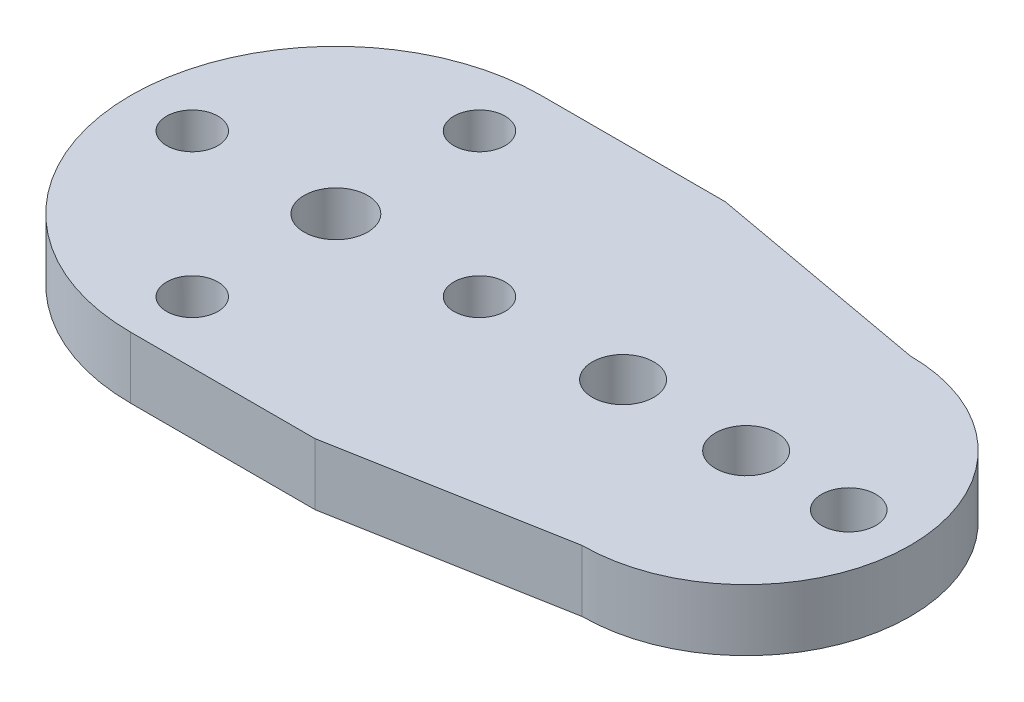
ISO-10303-21;
HEADER;
FILE_DESCRIPTION(('STEP AP214'),'2;1');
FILE_NAME('part.step','',(''),(''),'','','');
FILE_SCHEMA(('AUTOMOTIVE_DESIGN { 1 0 10303 214 1 1 1 1 }'));
ENDSEC;
DATA;
#1=APPLICATION_CONTEXT('core data for automotive mechanical design processes');
#2=APPLICATION_PROTOCOL_DEFINITION('international standard','automotive_design',2000,#1);
#3=PRODUCT_CONTEXT('',#1,'mechanical');
#4=PRODUCT('Part','Part','',(#3));
#5=PRODUCT_RELATED_PRODUCT_CATEGORY('part','',(#4));
#6=PRODUCT_DEFINITION_FORMATION('','',#4);
#7=PRODUCT_DEFINITION_CONTEXT('part definition',#1,'design');
#8=PRODUCT_DEFINITION('design','',#6,#7);
#9=PRODUCT_DEFINITION_SHAPE('','',#8);
#10=(LENGTH_UNIT() NAMED_UNIT(*) SI_UNIT(.MILLI.,.METRE.));
#11=(NAMED_UNIT(*) PLANE_ANGLE_UNIT() SI_UNIT($,.RADIAN.));
#12=(NAMED_UNIT(*) SI_UNIT($,.STERADIAN.) SOLID_ANGLE_UNIT());
#13=UNCERTAINTY_MEASURE_WITH_UNIT(LENGTH_MEASURE(1.E-05),#10,'distance_accuracy_value','');
#14=(GEOMETRIC_REPRESENTATION_CONTEXT(3) GLOBAL_UNCERTAINTY_ASSIGNED_CONTEXT((#13)) GLOBAL_UNIT_ASSIGNED_CONTEXT((#10,
#11,#12)) REPRESENTATION_CONTEXT('',''));
#15=CARTESIAN_POINT('',(0.,0.,0.));
#16=DIRECTION('',(0.,0.,1.));
#17=DIRECTION('',(1.,0.,0.));
#18=AXIS2_PLACEMENT_3D('',#15,#16,#17);
#19=CARTESIAN_POINT('',(-60.,3.,-9.99999999999999));
#20=DIRECTION('',(0.,1.,0.));
#21=DIRECTION('',(0.,0.,1.));
#22=AXIS2_PLACEMENT_3D('',#19,#20,#21);
#23=PLANE('',#22);
#24=CARTESIAN_POINT('',(-80.,3.,-17.));
#25=DIRECTION('',(0.,1.,0.));
#26=DIRECTION('',(0.,0.,1.));
#27=AXIS2_PLACEMENT_3D('',#24,#25,#26);
#28=CIRCLE('',#27,1.25);
#29=CARTESIAN_POINT('',(-80.,3.,-15.75));
#30=VERTEX_POINT('',#29);
#31=EDGE_CURVE('E240',#30,#30,#28,.F.);
#32=ORIENTED_EDGE('',*,*,#31,.T.);
#33=EDGE_LOOP('',(#32));
#34=FACE_BOUND('',#33,.T.);
#35=CARTESIAN_POINT('',(-80.,3.,-2.99999999999999));
#36=DIRECTION('',(0.,1.,0.));
#37=DIRECTION('',(0.,0.,1.));
#38=AXIS2_PLACEMENT_3D('',#35,#36,#37);
#39=CIRCLE('',#38,1.25);
#40=CARTESIAN_POINT('',(-80.,3.,-1.74999999999999));
#41=VERTEX_POINT('',#40);
#42=EDGE_CURVE('E273',#41,#41,#39,.F.);
#43=ORIENTED_EDGE('',*,*,#42,.T.);
#44=EDGE_LOOP('',(#43));
#45=FACE_BOUND('',#44,.T.);
#46=CARTESIAN_POINT('',(-87.,3.,-9.99999999999999));
#47=DIRECTION('',(0.,1.,0.));
#48=DIRECTION('',(0.,0.,1.));
#49=AXIS2_PLACEMENT_3D('',#46,#47,#48);
#50=CIRCLE('',#49,1.25);
#51=CARTESIAN_POINT('',(-87.,3.,-8.74999999999999));
#52=VERTEX_POINT('',#51);
#53=EDGE_CURVE('E270',#52,#52,#50,.F.);
#54=ORIENTED_EDGE('',*,*,#53,.T.);
#55=EDGE_LOOP('',(#54));
#56=FACE_BOUND('',#55,.T.);
#57=CARTESIAN_POINT('',(-73.,3.,-9.99999999999999));
#58=DIRECTION('',(0.,1.,0.));
#59=DIRECTION('',(0.,0.,1.));
#60=AXIS2_PLACEMENT_3D('',#57,#58,#59);
#61=CIRCLE('',#60,1.25);
#62=CARTESIAN_POINT('',(-73.,3.,-8.74999999999999));
#63=VERTEX_POINT('',#62);
#64=EDGE_CURVE('E267',#63,#63,#61,.F.);
#65=ORIENTED_EDGE('',*,*,#64,.T.);
#66=EDGE_LOOP('',(#65));
#67=FACE_BOUND('',#66,.T.);
#68=CARTESIAN_POINT('',(-66.,3.,-9.99999999999999));
#69=DIRECTION('',(0.,1.,0.));
#70=DIRECTION('',(0.,0.,1.));
#71=AXIS2_PLACEMENT_3D('',#68,#69,#70);
#72=CIRCLE('',#71,1.5);
#73=CARTESIAN_POINT('',(-66.,3.,-8.49999999999999));
#74=VERTEX_POINT('',#73);
#75=EDGE_CURVE('E248',#74,#74,#72,.F.);
#76=ORIENTED_EDGE('',*,*,#75,.T.);
#77=EDGE_LOOP('',(#76));
#78=FACE_BOUND('',#77,.T.);
#79=CARTESIAN_POINT('',(-55.,3.,-9.99999999999999));
#80=DIRECTION('',(0.,1.,0.));
#81=DIRECTION('',(0.,0.,1.));
#82=AXIS2_PLACEMENT_3D('',#79,#80,#81);
#83=CIRCLE('',#82,1.32170133931522);
#84=CARTESIAN_POINT('',(-55.,3.,-8.67829866068477));
#85=VERTEX_POINT('',#84);
#86=EDGE_CURVE('E244',#85,#85,#83,.F.);
#87=ORIENTED_EDGE('',*,*,#86,.T.);
#88=EDGE_LOOP('',(#87));
#89=FACE_BOUND('',#88,.T.);
#90=CARTESIAN_POINT('',(-80.,3.,-9.99999999999999));
#91=DIRECTION('',(0.,1.,0.));
#92=DIRECTION('',(0.,0.,1.));
#93=AXIS2_PLACEMENT_3D('',#90,#91,#92);
#94=CIRCLE('',#93,1.54999999999999);
#95=CARTESIAN_POINT('',(-80.,3.,-8.45));
#96=VERTEX_POINT('',#95);
#97=EDGE_CURVE('E164',#96,#96,#94,.T.);
#98=ORIENTED_EDGE('',*,*,#97,.F.);
#99=EDGE_LOOP('',(#98));
#100=FACE_BOUND('',#99,.T.);
#101=DIRECTION('',(0.983921388928392,0.,-0.178602072802149));
#102=VECTOR('',#101,1.);
#103=CARTESIAN_POINT('',(-71.0180287775086,3.,0.));
#104=LINE('',#103,#102);
#105=CARTESIAN_POINT('',(-71.0180287775086,3.,0.));
#106=VERTEX_POINT('',#105);
#107=CARTESIAN_POINT('',(-60.,3.,-1.99999999999999));
#108=VERTEX_POINT('',#107);
#109=EDGE_CURVE('E176',#106,#108,#104,.T.);
#110=ORIENTED_EDGE('',*,*,#109,.T.);
#111=CARTESIAN_POINT('',(-60.,3.,-9.99999999999999));
#112=DIRECTION('',(0.,1.,0.));
#113=DIRECTION('',(0.,0.,1.));
#114=AXIS2_PLACEMENT_3D('',#111,#112,#113);
#115=CIRCLE('',#114,8.);
#116=CARTESIAN_POINT('',(-60.,3.,-18.));
#117=VERTEX_POINT('',#116);
#118=EDGE_CURVE('E126',#108,#117,#115,.T.);
#119=ORIENTED_EDGE('',*,*,#118,.T.);
#120=DIRECTION('',(0.983921388928392,0.,0.178602072802149));
#121=VECTOR('',#120,1.);
#122=CARTESIAN_POINT('',(-71.0180287775086,3.,-20.));
#123=LINE('',#122,#121);
#124=CARTESIAN_POINT('',(-71.0180287775086,3.,-20.));
#125=VERTEX_POINT('',#124);
#126=EDGE_CURVE('E143',#125,#117,#123,.T.);
#127=ORIENTED_EDGE('',*,*,#126,.F.);
#128=DIRECTION('',(-1.,0.,0.));
#129=VECTOR('',#128,1.);
#130=CARTESIAN_POINT('',(-71.0180287775086,3.,-20.));
#131=LINE('',#130,#129);
#132=CARTESIAN_POINT('',(-80.,3.,-20.));
#133=VERTEX_POINT('',#132);
#134=EDGE_CURVE('E136',#125,#133,#131,.T.);
#135=ORIENTED_EDGE('',*,*,#134,.T.);
#136=CARTESIAN_POINT('',(-80.,3.,-9.99999999999999));
#137=DIRECTION('',(0.,1.,0.));
#138=DIRECTION('',(0.,0.,1.));
#139=AXIS2_PLACEMENT_3D('',#136,#137,#138);
#140=CIRCLE('',#139,9.99999999999999);
#141=CARTESIAN_POINT('',(-80.,3.,0.));
#142=VERTEX_POINT('',#141);
#143=EDGE_CURVE('E141',#133,#142,#140,.T.);
#144=ORIENTED_EDGE('',*,*,#143,.T.);
#145=DIRECTION('',(-1.,0.,0.));
#146=VECTOR('',#145,1.);
#147=CARTESIAN_POINT('',(-71.0180287775086,3.,0.));
#148=LINE('',#147,#146);
#149=EDGE_CURVE('E156',#106,#142,#148,.T.);
#150=ORIENTED_EDGE('',*,*,#149,.F.);
#151=EDGE_LOOP('',(#110,#119,#127,#135,#144,#150));
#152=FACE_BOUND('',#151,.T.);
#153=CARTESIAN_POINT('',(-60.,3.,-9.99999999999999));
#154=DIRECTION('',(0.,1.,0.));
#155=DIRECTION('',(0.,0.,1.));
#156=AXIS2_PLACEMENT_3D('',#153,#154,#155);
#157=CIRCLE('',#156,1.5);
#158=CARTESIAN_POINT('',(-60.,3.,-8.49999999999999));
#159=VERTEX_POINT('',#158);
#160=EDGE_CURVE('E278',#159,#159,#157,.T.);
#161=ORIENTED_EDGE('',*,*,#160,.F.);
#162=EDGE_LOOP('',(#161));
#163=FACE_BOUND('',#162,.T.);
#164=ADVANCED_FACE('F76',(#34,#45,#56,#67,#78,#89,#100,#152,#163),#23,.T.);
#165=CARTESIAN_POINT('',(-60.,0.,-9.99999999999999));
#166=DIRECTION('',(0.,1.,0.));
#167=DIRECTION('',(0.,0.,1.));
#168=AXIS2_PLACEMENT_3D('',#165,#166,#167);
#169=PLANE('',#168);
#170=CARTESIAN_POINT('',(-80.,0.,-17.));
#171=DIRECTION('',(0.,1.,0.));
#172=DIRECTION('',(0.,0.,1.));
#173=AXIS2_PLACEMENT_3D('',#170,#171,#172);
#174=CIRCLE('',#173,1.25);
#175=CARTESIAN_POINT('',(-80.,0.,-15.75));
#176=VERTEX_POINT('',#175);
#177=EDGE_CURVE('E243',#176,#176,#174,.T.);
#178=ORIENTED_EDGE('',*,*,#177,.T.);
#179=EDGE_LOOP('',(#178));
#180=FACE_BOUND('',#179,.T.);
#181=CARTESIAN_POINT('',(-80.,0.,-2.99999999999999));
#182=DIRECTION('',(0.,1.,0.));
#183=DIRECTION('',(0.,0.,-1.));
#184=AXIS2_PLACEMENT_3D('',#181,#182,#183);
#185=CIRCLE('',#184,1.25);
#186=CARTESIAN_POINT('',(-80.,0.,-4.24999999999999));
#187=VERTEX_POINT('',#186);
#188=EDGE_CURVE('E245',#187,#187,#185,.T.);
#189=ORIENTED_EDGE('',*,*,#188,.T.);
#190=EDGE_LOOP('',(#189));
#191=FACE_BOUND('',#190,.T.);
#192=CARTESIAN_POINT('',(-87.,0.,-9.99999999999999));
#193=DIRECTION('',(0.,1.,0.));
#194=DIRECTION('',(0.,0.,1.));
#195=AXIS2_PLACEMENT_3D('',#192,#193,#194);
#196=CIRCLE('',#195,1.25);
#197=CARTESIAN_POINT('',(-87.,0.,-8.74999999999999));
#198=VERTEX_POINT('',#197);
#199=EDGE_CURVE('E251',#198,#198,#196,.T.);
#200=ORIENTED_EDGE('',*,*,#199,.T.);
#201=EDGE_LOOP('',(#200));
#202=FACE_BOUND('',#201,.T.);
#203=CARTESIAN_POINT('',(-73.,0.,-9.99999999999999));
#204=DIRECTION('',(0.,1.,0.));
#205=DIRECTION('',(0.,0.,-1.));
#206=AXIS2_PLACEMENT_3D('',#203,#204,#205);
#207=CIRCLE('',#206,1.25);
#208=CARTESIAN_POINT('',(-73.,0.,-11.25));
#209=VERTEX_POINT('',#208);
#210=EDGE_CURVE('E256',#209,#209,#207,.T.);
#211=ORIENTED_EDGE('',*,*,#210,.T.);
#212=EDGE_LOOP('',(#211));
#213=FACE_BOUND('',#212,.T.);
#214=CARTESIAN_POINT('',(-66.,0.,-9.99999999999999));
#215=DIRECTION('',(0.,1.,0.));
#216=DIRECTION('',(0.,0.,1.));
#217=AXIS2_PLACEMENT_3D('',#214,#215,#216);
#218=CIRCLE('',#217,1.5);
#219=CARTESIAN_POINT('',(-66.,0.,-8.49999999999999));
#220=VERTEX_POINT('',#219);
#221=EDGE_CURVE('E259',#220,#220,#218,.T.);
#222=ORIENTED_EDGE('',*,*,#221,.T.);
#223=EDGE_LOOP('',(#222));
#224=FACE_BOUND('',#223,.T.);
#225=CARTESIAN_POINT('',(-55.,0.,-9.99999999999999));
#226=DIRECTION('',(0.,1.,0.));
#227=DIRECTION('',(0.,0.,1.));
#228=AXIS2_PLACEMENT_3D('',#225,#226,#227);
#229=CIRCLE('',#228,1.32170133931522);
#230=CARTESIAN_POINT('',(-55.,0.,-8.67829866068477));
#231=VERTEX_POINT('',#230);
#232=EDGE_CURVE('E262',#231,#231,#229,.T.);
#233=ORIENTED_EDGE('',*,*,#232,.T.);
#234=EDGE_LOOP('',(#233));
#235=FACE_BOUND('',#234,.T.);
#236=DIRECTION('',(0.983921388928392,0.,-0.178602072802149));
#237=VECTOR('',#236,1.);
#238=CARTESIAN_POINT('',(-71.0180287775086,0.,0.));
#239=LINE('',#238,#237);
#240=CARTESIAN_POINT('',(-71.0180287775086,0.,0.));
#241=VERTEX_POINT('',#240);
#242=CARTESIAN_POINT('',(-60.,0.,-1.99999999999999));
#243=VERTEX_POINT('',#242);
#244=EDGE_CURVE('E161',#241,#243,#239,.T.);
#245=ORIENTED_EDGE('',*,*,#244,.F.);
#246=DIRECTION('',(-1.,0.,0.));
#247=VECTOR('',#246,1.);
#248=CARTESIAN_POINT('',(-71.0180287775086,0.,0.));
#249=LINE('',#248,#247);
#250=CARTESIAN_POINT('',(-80.,0.,0.));
#251=VERTEX_POINT('',#250);
#252=EDGE_CURVE('E173',#241,#251,#249,.T.);
#253=ORIENTED_EDGE('',*,*,#252,.T.);
#254=CARTESIAN_POINT('',(-80.,0.,-9.99999999999999));
#255=DIRECTION('',(0.,1.,0.));
#256=DIRECTION('',(0.,0.,1.));
#257=AXIS2_PLACEMENT_3D('',#254,#255,#256);
#258=CIRCLE('',#257,9.99999999999999);
#259=CARTESIAN_POINT('',(-80.,0.,-20.));
#260=VERTEX_POINT('',#259);
#261=EDGE_CURVE('E171',#260,#251,#258,.T.);
#262=ORIENTED_EDGE('',*,*,#261,.F.);
#263=DIRECTION('',(-1.,0.,0.));
#264=VECTOR('',#263,1.);
#265=CARTESIAN_POINT('',(-71.0180287775086,0.,-20.));
#266=LINE('',#265,#264);
#267=CARTESIAN_POINT('',(-71.0180287775086,0.,-20.));
#268=VERTEX_POINT('',#267);
#269=EDGE_CURVE('E150',#268,#260,#266,.T.);
#270=ORIENTED_EDGE('',*,*,#269,.F.);
#271=DIRECTION('',(0.983921388928392,0.,0.178602072802149));
#272=VECTOR('',#271,1.);
#273=CARTESIAN_POINT('',(-71.0180287775086,0.,-20.));
#274=LINE('',#273,#272);
#275=CARTESIAN_POINT('',(-60.,0.,-18.));
#276=VERTEX_POINT('',#275);
#277=EDGE_CURVE('E167',#268,#276,#274,.T.);
#278=ORIENTED_EDGE('',*,*,#277,.T.);
#279=CARTESIAN_POINT('',(-60.,0.,-9.99999999999999));
#280=DIRECTION('',(0.,1.,0.));
#281=DIRECTION('',(0.,0.,1.));
#282=AXIS2_PLACEMENT_3D('',#279,#280,#281);
#283=CIRCLE('',#282,8.);
#284=EDGE_CURVE('E163',#243,#276,#283,.T.);
#285=ORIENTED_EDGE('',*,*,#284,.F.);
#286=EDGE_LOOP('',(#245,#253,#262,#270,#278,#285));
#287=FACE_BOUND('',#286,.T.);
#288=CARTESIAN_POINT('',(-80.,0.,-9.99999999999999));
#289=DIRECTION('',(0.,1.,0.));
#290=DIRECTION('',(0.,0.,1.));
#291=AXIS2_PLACEMENT_3D('',#288,#289,#290);
#292=CIRCLE('',#291,1.54999999999999);
#293=CARTESIAN_POINT('',(-80.,0.,-8.45));
#294=VERTEX_POINT('',#293);
#295=EDGE_CURVE('E281',#294,#294,#292,.T.);
#296=ORIENTED_EDGE('',*,*,#295,.T.);
#297=EDGE_LOOP('',(#296));
#298=FACE_BOUND('',#297,.T.);
#299=CARTESIAN_POINT('',(-60.,0.,-9.99999999999999));
#300=DIRECTION('',(0.,1.,0.));
#301=DIRECTION('',(0.,0.,1.));
#302=AXIS2_PLACEMENT_3D('',#299,#300,#301);
#303=CIRCLE('',#302,1.5);
#304=CARTESIAN_POINT('',(-60.,0.,-8.49999999999999));
#305=VERTEX_POINT('',#304);
#306=EDGE_CURVE('E277',#305,#305,#303,.T.);
#307=ORIENTED_EDGE('',*,*,#306,.T.);
#308=EDGE_LOOP('',(#307));
#309=FACE_BOUND('',#308,.T.);
#310=ADVANCED_FACE('F185',(#180,#191,#202,#213,#224,#235,#287,#298,#309),#169,.F.);
#311=CARTESIAN_POINT('',(-71.0180287775086,3.,0.));
#312=DIRECTION('',(-0.178602072802149,0.,-0.983921388928392));
#313=DIRECTION('',(-0.983921388928392,0.,0.178602072802149));
#314=AXIS2_PLACEMENT_3D('',#311,#312,#313);
#315=PLANE('',#314);
#316=ORIENTED_EDGE('',*,*,#244,.T.);
#317=DIRECTION('',(0.,-1.,0.));
#318=VECTOR('',#317,1.);
#319=CARTESIAN_POINT('',(-60.,3.,-1.99999999999999));
#320=LINE('',#319,#318);
#321=EDGE_CURVE('E12',#108,#243,#320,.T.);
#322=ORIENTED_EDGE('',*,*,#321,.F.);
#323=ORIENTED_EDGE('',*,*,#109,.F.);
#324=DIRECTION('',(0.,-1.,0.));
#325=VECTOR('',#324,1.);
#326=CARTESIAN_POINT('',(-71.0180287775086,3.,0.));
#327=LINE('',#326,#325);
#328=EDGE_CURVE('E93',#106,#241,#327,.T.);
#329=ORIENTED_EDGE('',*,*,#328,.T.);
#330=EDGE_LOOP('',(#316,#322,#323,#329));
#331=FACE_BOUND('',#330,.T.);
#332=ADVANCED_FACE('F78',(#331),#315,.F.);
#333=CARTESIAN_POINT('',(-60.,3.,-9.99999999999999));
#334=DIRECTION('',(0.,-1.,0.));
#335=DIRECTION('',(0.,0.,-1.));
#336=AXIS2_PLACEMENT_3D('',#333,#334,#335);
#337=CYLINDRICAL_SURFACE('',#336,8.);
#338=ORIENTED_EDGE('',*,*,#284,.T.);
#339=DIRECTION('',(0.,-1.,0.));
#340=VECTOR('',#339,1.);
#341=CARTESIAN_POINT('',(-60.,3.,-18.));
#342=LINE('',#341,#340);
#343=EDGE_CURVE('E85',#117,#276,#342,.T.);
#344=ORIENTED_EDGE('',*,*,#343,.F.);
#345=ORIENTED_EDGE('',*,*,#118,.F.);
#346=ORIENTED_EDGE('',*,*,#321,.T.);
#347=EDGE_LOOP('',(#338,#344,#345,#346));
#348=FACE_BOUND('',#347,.T.);
#349=ADVANCED_FACE('F182',(#348),#337,.T.);
#350=CARTESIAN_POINT('',(-71.0180287775086,3.,-20.));
#351=DIRECTION('',(0.178602072802149,0.,-0.983921388928392));
#352=DIRECTION('',(-0.983921388928392,0.,-0.178602072802149));
#353=AXIS2_PLACEMENT_3D('',#350,#351,#352);
#354=PLANE('',#353);
#355=ORIENTED_EDGE('',*,*,#277,.F.);
#356=DIRECTION('',(0.,-1.,0.));
#357=VECTOR('',#356,1.);
#358=CARTESIAN_POINT('',(-71.0180287775086,3.,-20.));
#359=LINE('',#358,#357);
#360=EDGE_CURVE('E153',#125,#268,#359,.T.);
#361=ORIENTED_EDGE('',*,*,#360,.F.);
#362=ORIENTED_EDGE('',*,*,#126,.T.);
#363=ORIENTED_EDGE('',*,*,#343,.T.);
#364=EDGE_LOOP('',(#355,#361,#362,#363));
#365=FACE_BOUND('',#364,.T.);
#366=ADVANCED_FACE('F181',(#365),#354,.T.);
#367=CARTESIAN_POINT('',(-71.0180287775086,3.,-20.));
#368=DIRECTION('',(0.,0.,1.));
#369=DIRECTION('',(1.,0.,0.));
#370=AXIS2_PLACEMENT_3D('',#367,#368,#369);
#371=PLANE('',#370);
#372=ORIENTED_EDGE('',*,*,#269,.T.);
#373=DIRECTION('',(0.,-1.,0.));
#374=VECTOR('',#373,1.);
#375=CARTESIAN_POINT('',(-80.,3.,-20.));
#376=LINE('',#375,#374);
#377=EDGE_CURVE('E147',#133,#260,#376,.T.);
#378=ORIENTED_EDGE('',*,*,#377,.F.);
#379=ORIENTED_EDGE('',*,*,#134,.F.);
#380=ORIENTED_EDGE('',*,*,#360,.T.);
#381=EDGE_LOOP('',(#372,#378,#379,#380));
#382=FACE_BOUND('',#381,.T.);
#383=ADVANCED_FACE('F148',(#382),#371,.F.);
#384=CARTESIAN_POINT('',(-80.,3.,-9.99999999999999));
#385=DIRECTION('',(0.,-1.,0.));
#386=DIRECTION('',(0.,0.,-1.));
#387=AXIS2_PLACEMENT_3D('',#384,#385,#386);
#388=CYLINDRICAL_SURFACE('',#387,9.99999999999999);
#389=ORIENTED_EDGE('',*,*,#261,.T.);
#390=DIRECTION('',(0.,-1.,0.));
#391=VECTOR('',#390,1.);
#392=CARTESIAN_POINT('',(-80.,3.,0.));
#393=LINE('',#392,#391);
#394=EDGE_CURVE('E114',#142,#251,#393,.T.);
#395=ORIENTED_EDGE('',*,*,#394,.F.);
#396=ORIENTED_EDGE('',*,*,#143,.F.);
#397=ORIENTED_EDGE('',*,*,#377,.T.);
#398=EDGE_LOOP('',(#389,#395,#396,#397));
#399=FACE_BOUND('',#398,.T.);
#400=ADVANCED_FACE('F155',(#399),#388,.T.);
#401=CARTESIAN_POINT('',(-71.0180287775086,3.,0.));
#402=DIRECTION('',(0.,0.,1.));
#403=DIRECTION('',(1.,0.,0.));
#404=AXIS2_PLACEMENT_3D('',#401,#402,#403);
#405=PLANE('',#404);
#406=ORIENTED_EDGE('',*,*,#252,.F.);
#407=ORIENTED_EDGE('',*,*,#328,.F.);
#408=ORIENTED_EDGE('',*,*,#149,.T.);
#409=ORIENTED_EDGE('',*,*,#394,.T.);
#410=EDGE_LOOP('',(#406,#407,#408,#409));
#411=FACE_BOUND('',#410,.T.);
#412=ADVANCED_FACE('F187',(#411),#405,.T.);
#413=CARTESIAN_POINT('',(-80.,3.,-9.99999999999999));
#414=DIRECTION('',(0.,-1.,0.));
#415=DIRECTION('',(0.,0.,-1.));
#416=AXIS2_PLACEMENT_3D('',#413,#414,#415);
#417=CYLINDRICAL_SURFACE('',#416,1.54999999999999);
#418=ORIENTED_EDGE('',*,*,#97,.T.);
#419=EDGE_LOOP('',(#418));
#420=FACE_BOUND('',#419,.T.);
#421=ORIENTED_EDGE('',*,*,#295,.F.);
#422=EDGE_LOOP('',(#421));
#423=FACE_BOUND('',#422,.T.);
#424=ADVANCED_FACE('F189',(#420,#423),#417,.F.);
#425=CARTESIAN_POINT('',(-60.,3.,-9.99999999999999));
#426=DIRECTION('',(0.,-1.,0.));
#427=DIRECTION('',(0.,0.,-1.));
#428=AXIS2_PLACEMENT_3D('',#425,#426,#427);
#429=CYLINDRICAL_SURFACE('',#428,1.5);
#430=ORIENTED_EDGE('',*,*,#160,.T.);
#431=EDGE_LOOP('',(#430));
#432=FACE_BOUND('',#431,.T.);
#433=ORIENTED_EDGE('',*,*,#306,.F.);
#434=EDGE_LOOP('',(#433));
#435=FACE_BOUND('',#434,.T.);
#436=ADVANCED_FACE('F195',(#432,#435),#429,.F.);
#437=CARTESIAN_POINT('',(-55.,10.,-9.99999999999999));
#438=DIRECTION('',(0.,-1.,0.));
#439=DIRECTION('',(0.,0.,-1.));
#440=AXIS2_PLACEMENT_3D('',#437,#438,#439);
#441=CYLINDRICAL_SURFACE('',#440,1.32170133931522);
#442=ORIENTED_EDGE('',*,*,#86,.F.);
#443=EDGE_LOOP('',(#442));
#444=FACE_BOUND('',#443,.T.);
#445=ORIENTED_EDGE('',*,*,#232,.F.);
#446=EDGE_LOOP('',(#445));
#447=FACE_BOUND('',#446,.T.);
#448=ADVANCED_FACE('F212',(#444,#447),#441,.F.);
#449=CARTESIAN_POINT('',(-66.,10.,-9.99999999999999));
#450=DIRECTION('',(0.,-1.,0.));
#451=DIRECTION('',(0.,0.,-1.));
#452=AXIS2_PLACEMENT_3D('',#449,#450,#451);
#453=CYLINDRICAL_SURFACE('',#452,1.5);
#454=ORIENTED_EDGE('',*,*,#75,.F.);
#455=EDGE_LOOP('',(#454));
#456=FACE_BOUND('',#455,.T.);
#457=ORIENTED_EDGE('',*,*,#221,.F.);
#458=EDGE_LOOP('',(#457));
#459=FACE_BOUND('',#458,.T.);
#460=ADVANCED_FACE('F216',(#456,#459),#453,.F.);
#461=CARTESIAN_POINT('',(-73.,10.,-9.99999999999999));
#462=DIRECTION('',(0.,-1.,0.));
#463=DIRECTION('',(0.,0.,-1.));
#464=AXIS2_PLACEMENT_3D('',#461,#462,#463);
#465=CYLINDRICAL_SURFACE('',#464,1.25);
#466=ORIENTED_EDGE('',*,*,#64,.F.);
#467=EDGE_LOOP('',(#466));
#468=FACE_BOUND('',#467,.T.);
#469=ORIENTED_EDGE('',*,*,#210,.F.);
#470=EDGE_LOOP('',(#469));
#471=FACE_BOUND('',#470,.T.);
#472=ADVANCED_FACE('F220',(#468,#471),#465,.F.);
#473=CARTESIAN_POINT('',(-87.,10.,-9.99999999999999));
#474=DIRECTION('',(0.,-1.,0.));
#475=DIRECTION('',(0.,0.,-1.));
#476=AXIS2_PLACEMENT_3D('',#473,#474,#475);
#477=CYLINDRICAL_SURFACE('',#476,1.25);
#478=ORIENTED_EDGE('',*,*,#53,.F.);
#479=EDGE_LOOP('',(#478));
#480=FACE_BOUND('',#479,.T.);
#481=ORIENTED_EDGE('',*,*,#199,.F.);
#482=EDGE_LOOP('',(#481));
#483=FACE_BOUND('',#482,.T.);
#484=ADVANCED_FACE('F224',(#480,#483),#477,.F.);
#485=CARTESIAN_POINT('',(-80.,10.,-2.99999999999999));
#486=DIRECTION('',(0.,-1.,0.));
#487=DIRECTION('',(0.,0.,-1.));
#488=AXIS2_PLACEMENT_3D('',#485,#486,#487);
#489=CYLINDRICAL_SURFACE('',#488,1.25);
#490=ORIENTED_EDGE('',*,*,#42,.F.);
#491=EDGE_LOOP('',(#490));
#492=FACE_BOUND('',#491,.T.);
#493=ORIENTED_EDGE('',*,*,#188,.F.);
#494=EDGE_LOOP('',(#493));
#495=FACE_BOUND('',#494,.T.);
#496=ADVANCED_FACE('F228',(#492,#495),#489,.F.);
#497=CARTESIAN_POINT('',(-80.,10.,-17.));
#498=DIRECTION('',(0.,-1.,0.));
#499=DIRECTION('',(0.,0.,-1.));
#500=AXIS2_PLACEMENT_3D('',#497,#498,#499);
#501=CYLINDRICAL_SURFACE('',#500,1.25);
#502=ORIENTED_EDGE('',*,*,#31,.F.);
#503=EDGE_LOOP('',(#502));
#504=FACE_BOUND('',#503,.T.);
#505=ORIENTED_EDGE('',*,*,#177,.F.);
#506=EDGE_LOOP('',(#505));
#507=FACE_BOUND('',#506,.T.);
#508=ADVANCED_FACE('F232',(#504,#507),#501,.F.);
#509=CLOSED_SHELL('',(#164,#310,#332,#349,#366,#383,#400,#412,#424,#436,#448,#460,#472,#484,
#496,#508));
#510=MANIFOLD_SOLID_BREP('B2',#509);
#511=ADVANCED_BREP_SHAPE_REPRESENTATION('',(#18,#510),#14);
#512=SHAPE_DEFINITION_REPRESENTATION(#9,#511);
ENDSEC;
END-ISO-10303-21;
